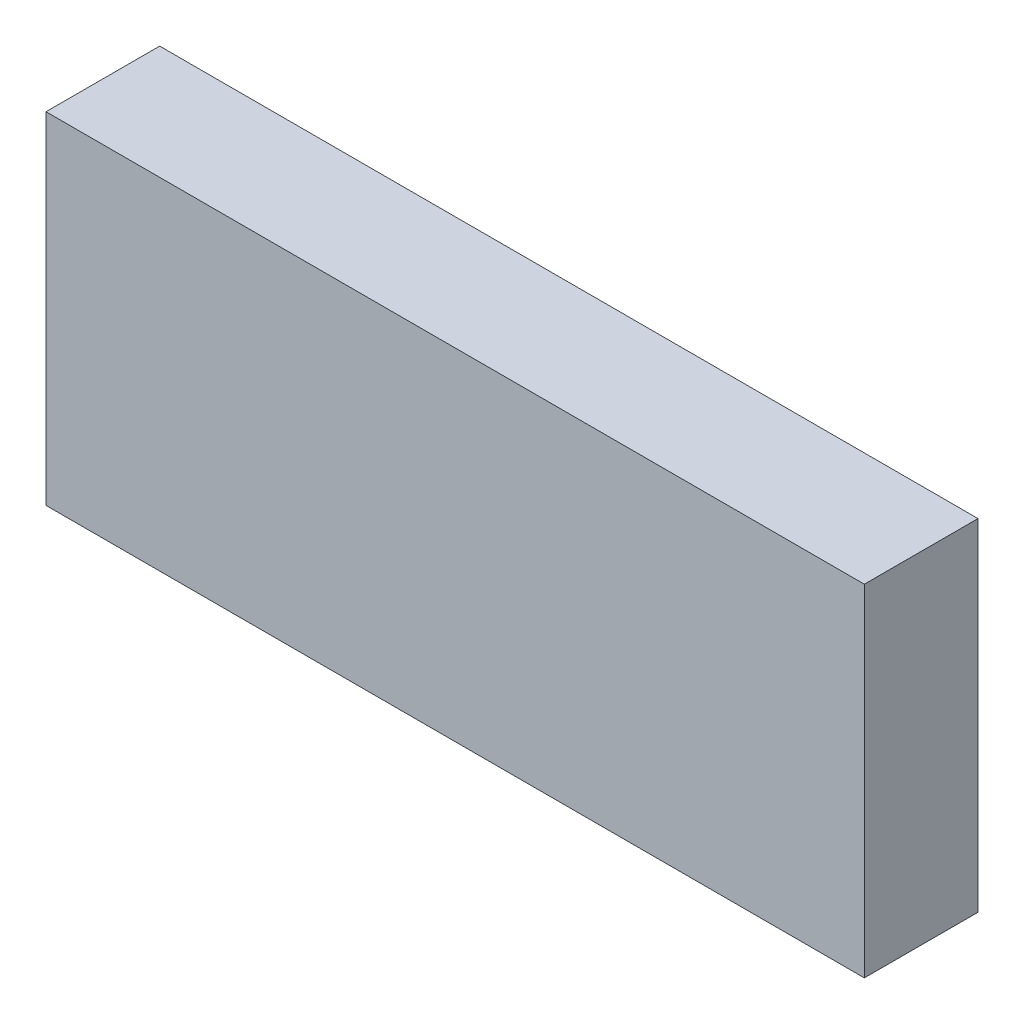
ISO-10303-21;
HEADER;
FILE_DESCRIPTION(('STEP AP214'),'2;1');
FILE_NAME('part.step','',(''),(''),'','','');
FILE_SCHEMA(('AUTOMOTIVE_DESIGN { 1 0 10303 214 1 1 1 1 }'));
ENDSEC;
DATA;
#1=APPLICATION_CONTEXT('core data for automotive mechanical design processes');
#2=APPLICATION_PROTOCOL_DEFINITION('international standard','automotive_design',2000,#1);
#3=PRODUCT_CONTEXT('',#1,'mechanical');
#4=PRODUCT('Part','Part','',(#3));
#5=PRODUCT_RELATED_PRODUCT_CATEGORY('part','',(#4));
#6=PRODUCT_DEFINITION_FORMATION('','',#4);
#7=PRODUCT_DEFINITION_CONTEXT('part definition',#1,'design');
#8=PRODUCT_DEFINITION('design','',#6,#7);
#9=PRODUCT_DEFINITION_SHAPE('','',#8);
#10=(LENGTH_UNIT() NAMED_UNIT(*) SI_UNIT(.MILLI.,.METRE.));
#11=(NAMED_UNIT(*) PLANE_ANGLE_UNIT() SI_UNIT($,.RADIAN.));
#12=(NAMED_UNIT(*) SI_UNIT($,.STERADIAN.) SOLID_ANGLE_UNIT());
#13=UNCERTAINTY_MEASURE_WITH_UNIT(LENGTH_MEASURE(1.E-05),#10,'distance_accuracy_value','');
#14=(GEOMETRIC_REPRESENTATION_CONTEXT(3) GLOBAL_UNCERTAINTY_ASSIGNED_CONTEXT((#13)) GLOBAL_UNIT_ASSIGNED_CONTEXT((#10,
#11,#12)) REPRESENTATION_CONTEXT('',''));
#15=CARTESIAN_POINT('',(0.,0.,0.));
#16=DIRECTION('',(0.,0.,1.));
#17=DIRECTION('',(1.,0.,0.));
#18=AXIS2_PLACEMENT_3D('',#15,#16,#17);
#19=CARTESIAN_POINT('',(0.,0.,31.75));
#20=DIRECTION('',(1.,0.,0.));
#21=DIRECTION('',(0.,0.,-1.));
#22=AXIS2_PLACEMENT_3D('',#19,#20,#21);
#23=PLANE('',#22);
#24=DIRECTION('',(0.,-1.,0.));
#25=VECTOR('',#24,1.);
#26=CARTESIAN_POINT('',(0.,0.,0.));
#27=LINE('',#26,#25);
#28=CARTESIAN_POINT('',(0.,95.25,0.));
#29=VERTEX_POINT('',#28);
#30=CARTESIAN_POINT('',(0.,0.,0.));
#31=VERTEX_POINT('',#30);
#32=EDGE_CURVE('E97',#29,#31,#27,.T.);
#33=ORIENTED_EDGE('',*,*,#32,.T.);
#34=DIRECTION('',(0.,0.,-1.));
#35=VECTOR('',#34,1.);
#36=CARTESIAN_POINT('',(0.,0.,31.75));
#37=LINE('',#36,#35);
#38=CARTESIAN_POINT('',(0.,0.,31.75));
#39=VERTEX_POINT('',#38);
#40=EDGE_CURVE('E11',#39,#31,#37,.T.);
#41=ORIENTED_EDGE('',*,*,#40,.F.);
#42=DIRECTION('',(0.,-1.,0.));
#43=VECTOR('',#42,1.);
#44=CARTESIAN_POINT('',(0.,0.,31.75));
#45=LINE('',#44,#43);
#46=CARTESIAN_POINT('',(0.,95.25,31.75));
#47=VERTEX_POINT('',#46);
#48=EDGE_CURVE('E85',#47,#39,#45,.T.);
#49=ORIENTED_EDGE('',*,*,#48,.F.);
#50=DIRECTION('',(0.,0.,-1.));
#51=VECTOR('',#50,1.);
#52=CARTESIAN_POINT('',(0.,95.25,31.75));
#53=LINE('',#52,#51);
#54=EDGE_CURVE('E93',#47,#29,#53,.T.);
#55=ORIENTED_EDGE('',*,*,#54,.T.);
#56=EDGE_LOOP('',(#33,#41,#49,#55));
#57=FACE_BOUND('',#56,.T.);
#58=ADVANCED_FACE('F34',(#57),#23,.F.);
#59=CARTESIAN_POINT('',(0.,0.,31.75));
#60=DIRECTION('',(0.,1.,0.));
#61=DIRECTION('',(0.,0.,1.));
#62=AXIS2_PLACEMENT_3D('',#59,#60,#61);
#63=PLANE('',#62);
#64=DIRECTION('',(1.,0.,0.));
#65=VECTOR('',#64,1.);
#66=CARTESIAN_POINT('',(0.,0.,0.));
#67=LINE('',#66,#65);
#68=CARTESIAN_POINT('',(228.6,0.,0.));
#69=VERTEX_POINT('',#68);
#70=EDGE_CURVE('E89',#31,#69,#67,.T.);
#71=ORIENTED_EDGE('',*,*,#70,.T.);
#72=DIRECTION('',(0.,0.,-1.));
#73=VECTOR('',#72,1.);
#74=CARTESIAN_POINT('',(228.6,0.,31.75));
#75=LINE('',#74,#73);
#76=CARTESIAN_POINT('',(228.6,0.,31.75));
#77=VERTEX_POINT('',#76);
#78=EDGE_CURVE('E42',#77,#69,#75,.T.);
#79=ORIENTED_EDGE('',*,*,#78,.F.);
#80=DIRECTION('',(1.,0.,0.));
#81=VECTOR('',#80,1.);
#82=CARTESIAN_POINT('',(0.,0.,31.75));
#83=LINE('',#82,#81);
#84=EDGE_CURVE('E80',#39,#77,#83,.T.);
#85=ORIENTED_EDGE('',*,*,#84,.F.);
#86=ORIENTED_EDGE('',*,*,#40,.T.);
#87=EDGE_LOOP('',(#71,#79,#85,#86));
#88=FACE_BOUND('',#87,.T.);
#89=ADVANCED_FACE('F88',(#88),#63,.F.);
#90=CARTESIAN_POINT('',(228.6,0.,31.75));
#91=DIRECTION('',(-1.,0.,0.));
#92=DIRECTION('',(0.,0.,1.));
#93=AXIS2_PLACEMENT_3D('',#90,#91,#92);
#94=PLANE('',#93);
#95=DIRECTION('',(0.,1.,0.));
#96=VECTOR('',#95,1.);
#97=CARTESIAN_POINT('',(228.6,0.,0.));
#98=LINE('',#97,#96);
#99=CARTESIAN_POINT('',(228.6,95.25,0.));
#100=VERTEX_POINT('',#99);
#101=EDGE_CURVE('E67',#69,#100,#98,.T.);
#102=ORIENTED_EDGE('',*,*,#101,.T.);
#103=DIRECTION('',(0.,0.,-1.));
#104=VECTOR('',#103,1.);
#105=CARTESIAN_POINT('',(228.6,95.25,31.75));
#106=LINE('',#105,#104);
#107=CARTESIAN_POINT('',(228.6,95.25,31.75));
#108=VERTEX_POINT('',#107);
#109=EDGE_CURVE('E90',#108,#100,#106,.T.);
#110=ORIENTED_EDGE('',*,*,#109,.F.);
#111=DIRECTION('',(0.,1.,0.));
#112=VECTOR('',#111,1.);
#113=CARTESIAN_POINT('',(228.6,0.,31.75));
#114=LINE('',#113,#112);
#115=EDGE_CURVE('E83',#77,#108,#114,.T.);
#116=ORIENTED_EDGE('',*,*,#115,.F.);
#117=ORIENTED_EDGE('',*,*,#78,.T.);
#118=EDGE_LOOP('',(#102,#110,#116,#117));
#119=FACE_BOUND('',#118,.T.);
#120=ADVANCED_FACE('F91',(#119),#94,.F.);
#121=CARTESIAN_POINT('',(0.,95.25,31.75));
#122=DIRECTION('',(0.,-1.,0.));
#123=DIRECTION('',(0.,0.,-1.));
#124=AXIS2_PLACEMENT_3D('',#121,#122,#123);
#125=PLANE('',#124);
#126=DIRECTION('',(-1.,0.,0.));
#127=VECTOR('',#126,1.);
#128=CARTESIAN_POINT('',(0.,95.25,0.));
#129=LINE('',#128,#127);
#130=EDGE_CURVE('E73',#100,#29,#129,.T.);
#131=ORIENTED_EDGE('',*,*,#130,.T.);
#132=ORIENTED_EDGE('',*,*,#54,.F.);
#133=DIRECTION('',(-1.,0.,0.));
#134=VECTOR('',#133,1.);
#135=CARTESIAN_POINT('',(0.,95.25,31.75));
#136=LINE('',#135,#134);
#137=EDGE_CURVE('E50',#108,#47,#136,.T.);
#138=ORIENTED_EDGE('',*,*,#137,.F.);
#139=ORIENTED_EDGE('',*,*,#109,.T.);
#140=EDGE_LOOP('',(#131,#132,#138,#139));
#141=FACE_BOUND('',#140,.T.);
#142=ADVANCED_FACE('F104',(#141),#125,.F.);
#143=CARTESIAN_POINT('',(0.,0.,31.75));
#144=DIRECTION('',(0.,0.,-1.));
#145=DIRECTION('',(-1.,0.,0.));
#146=AXIS2_PLACEMENT_3D('',#143,#144,#145);
#147=PLANE('',#146);
#148=ORIENTED_EDGE('',*,*,#48,.T.);
#149=ORIENTED_EDGE('',*,*,#84,.T.);
#150=ORIENTED_EDGE('',*,*,#115,.T.);
#151=ORIENTED_EDGE('',*,*,#137,.T.);
#152=EDGE_LOOP('',(#148,#149,#150,#151));
#153=FACE_BOUND('',#152,.T.);
#154=ADVANCED_FACE('F81',(#153),#147,.F.);
#155=CARTESIAN_POINT('',(0.,0.,0.));
#156=DIRECTION('',(0.,0.,-1.));
#157=DIRECTION('',(-1.,0.,0.));
#158=AXIS2_PLACEMENT_3D('',#155,#156,#157);
#159=PLANE('',#158);
#160=ORIENTED_EDGE('',*,*,#32,.F.);
#161=ORIENTED_EDGE('',*,*,#130,.F.);
#162=ORIENTED_EDGE('',*,*,#101,.F.);
#163=ORIENTED_EDGE('',*,*,#70,.F.);
#164=EDGE_LOOP('',(#160,#161,#162,#163));
#165=FACE_BOUND('',#164,.T.);
#166=ADVANCED_FACE('F107',(#165),#159,.T.);
#167=CLOSED_SHELL('',(#58,#89,#120,#142,#154,#166));
#168=MANIFOLD_SOLID_BREP('B2',#167);
#169=ADVANCED_BREP_SHAPE_REPRESENTATION('',(#18,#168),#14);
#170=SHAPE_DEFINITION_REPRESENTATION(#9,#169);
ENDSEC;
END-ISO-10303-21;
